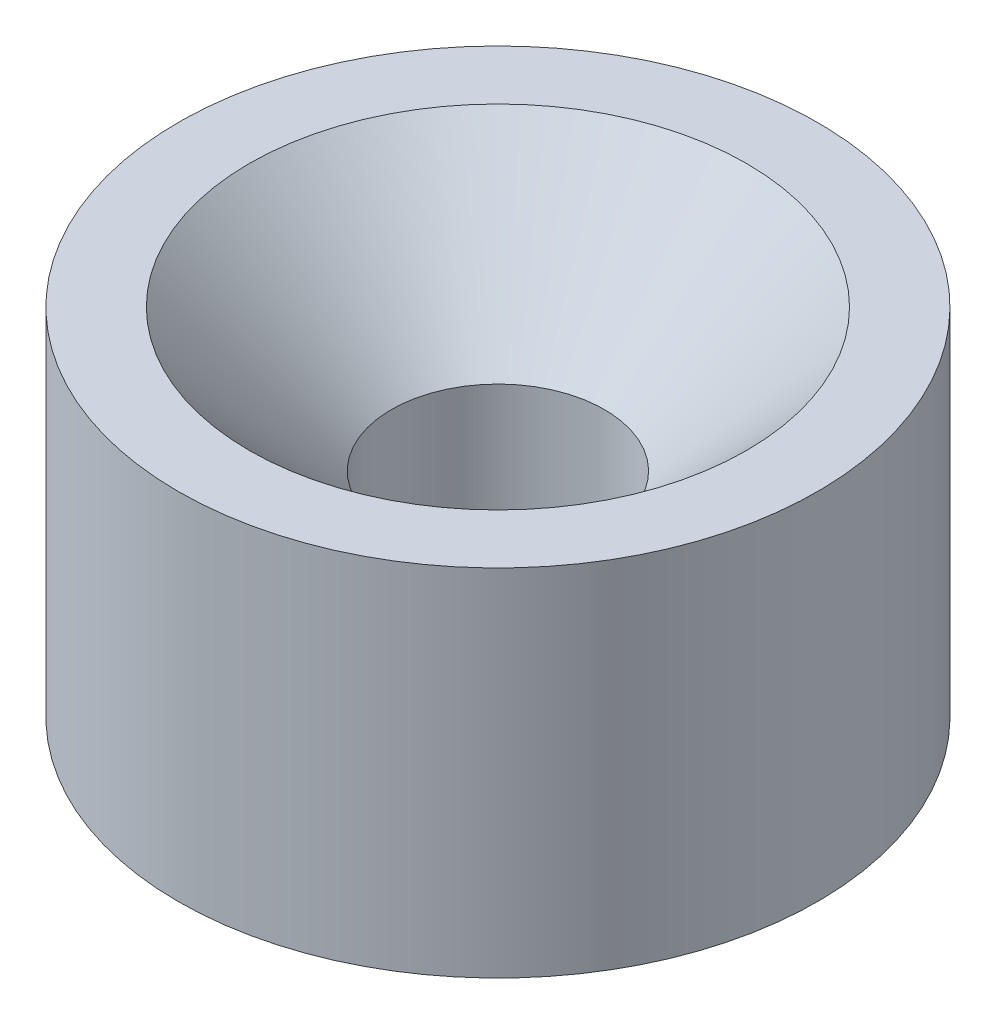
ISO-10303-21;
HEADER;
FILE_DESCRIPTION(('STEP AP214'),'2;1');
FILE_NAME('part.step','',(''),(''),'','','');
FILE_SCHEMA(('AUTOMOTIVE_DESIGN { 1 0 10303 214 1 1 1 1 }'));
ENDSEC;
DATA;
#1=APPLICATION_CONTEXT('core data for automotive mechanical design processes');
#2=APPLICATION_PROTOCOL_DEFINITION('international standard','automotive_design',2000,#1);
#3=PRODUCT_CONTEXT('',#1,'mechanical');
#4=PRODUCT('Part','Part','',(#3));
#5=PRODUCT_RELATED_PRODUCT_CATEGORY('part','',(#4));
#6=PRODUCT_DEFINITION_FORMATION('','',#4);
#7=PRODUCT_DEFINITION_CONTEXT('part definition',#1,'design');
#8=PRODUCT_DEFINITION('design','',#6,#7);
#9=PRODUCT_DEFINITION_SHAPE('','',#8);
#10=(LENGTH_UNIT() NAMED_UNIT(*) SI_UNIT(.MILLI.,.METRE.));
#11=(NAMED_UNIT(*) PLANE_ANGLE_UNIT() SI_UNIT($,.RADIAN.));
#12=(NAMED_UNIT(*) SI_UNIT($,.STERADIAN.) SOLID_ANGLE_UNIT());
#13=UNCERTAINTY_MEASURE_WITH_UNIT(LENGTH_MEASURE(1.E-05),#10,'distance_accuracy_value','');
#14=(GEOMETRIC_REPRESENTATION_CONTEXT(3) GLOBAL_UNCERTAINTY_ASSIGNED_CONTEXT((#13)) GLOBAL_UNIT_ASSIGNED_CONTEXT((#10,
#11,#12)) REPRESENTATION_CONTEXT('',''));
#15=CARTESIAN_POINT('',(0.,0.,0.));
#16=DIRECTION('',(0.,0.,1.));
#17=DIRECTION('',(1.,0.,0.));
#18=AXIS2_PLACEMENT_3D('',#15,#16,#17);
#19=CARTESIAN_POINT('',(0.,5.,0.));
#20=DIRECTION('',(0.,1.,0.));
#21=DIRECTION('',(0.,0.,1.));
#22=AXIS2_PLACEMENT_3D('',#19,#20,#21);
#23=PLANE('',#22);
#24=CARTESIAN_POINT('',(0.,5.,0.));
#25=DIRECTION('',(0.,1.,0.));
#26=DIRECTION('',(0.,0.,1.));
#27=AXIS2_PLACEMENT_3D('',#24,#25,#26);
#28=CIRCLE('',#27,3.50000000000001);
#29=CARTESIAN_POINT('',(0.,5.,3.50000000000001));
#30=VERTEX_POINT('',#29);
#31=EDGE_CURVE('E10',#30,#30,#28,.F.);
#32=ORIENTED_EDGE('',*,*,#31,.T.);
#33=EDGE_LOOP('',(#32));
#34=FACE_BOUND('',#33,.T.);
#35=CARTESIAN_POINT('',(0.,5.,0.));
#36=DIRECTION('',(0.,1.,0.));
#37=DIRECTION('',(0.,0.,1.));
#38=AXIS2_PLACEMENT_3D('',#35,#36,#37);
#39=CIRCLE('',#38,4.5);
#40=CARTESIAN_POINT('',(0.,5.,4.5));
#41=VERTEX_POINT('',#40);
#42=EDGE_CURVE('E51',#41,#41,#39,.T.);
#43=ORIENTED_EDGE('',*,*,#42,.T.);
#44=EDGE_LOOP('',(#43));
#45=FACE_BOUND('',#44,.T.);
#46=ADVANCED_FACE('F39',(#34,#45),#23,.T.);
#47=CARTESIAN_POINT('',(0.,0.,0.));
#48=DIRECTION('',(0.,1.,0.));
#49=DIRECTION('',(0.,0.,1.));
#50=AXIS2_PLACEMENT_3D('',#47,#48,#49);
#51=PLANE('',#50);
#52=CARTESIAN_POINT('',(0.,0.,0.));
#53=DIRECTION('',(0.,1.,0.));
#54=DIRECTION('',(0.,0.,1.));
#55=AXIS2_PLACEMENT_3D('',#52,#53,#54);
#56=CIRCLE('',#55,4.5);
#57=CARTESIAN_POINT('',(0.,0.,4.5));
#58=VERTEX_POINT('',#57);
#59=EDGE_CURVE('E55',#58,#58,#56,.T.);
#60=ORIENTED_EDGE('',*,*,#59,.F.);
#61=EDGE_LOOP('',(#60));
#62=FACE_BOUND('',#61,.T.);
#63=CARTESIAN_POINT('',(0.,0.,0.));
#64=DIRECTION('',(0.,1.,0.));
#65=DIRECTION('',(0.,0.,1.));
#66=AXIS2_PLACEMENT_3D('',#63,#64,#65);
#67=CIRCLE('',#66,1.5);
#68=CARTESIAN_POINT('',(0.,0.,1.5));
#69=VERTEX_POINT('',#68);
#70=EDGE_CURVE('E59',#69,#69,#67,.T.);
#71=ORIENTED_EDGE('',*,*,#70,.T.);
#72=EDGE_LOOP('',(#71));
#73=FACE_BOUND('',#72,.T.);
#74=ADVANCED_FACE('F64',(#62,#73),#51,.F.);
#75=CARTESIAN_POINT('',(0.,5.,0.));
#76=DIRECTION('',(0.,-1.,0.));
#77=DIRECTION('',(0.,0.,-1.));
#78=AXIS2_PLACEMENT_3D('',#75,#76,#77);
#79=CYLINDRICAL_SURFACE('',#78,4.5);
#80=ORIENTED_EDGE('',*,*,#42,.F.);
#81=EDGE_LOOP('',(#80));
#82=FACE_BOUND('',#81,.T.);
#83=ORIENTED_EDGE('',*,*,#59,.T.);
#84=EDGE_LOOP('',(#83));
#85=FACE_BOUND('',#84,.T.);
#86=ADVANCED_FACE('F68',(#82,#85),#79,.T.);
#87=CARTESIAN_POINT('',(0.,5.,0.));
#88=DIRECTION('',(0.,-1.,0.));
#89=DIRECTION('',(0.,0.,-1.));
#90=AXIS2_PLACEMENT_3D('',#87,#88,#89);
#91=CYLINDRICAL_SURFACE('',#90,1.5);
#92=CARTESIAN_POINT('',(0.,3.,0.));
#93=DIRECTION('',(0.,1.,0.));
#94=DIRECTION('',(0.,0.,1.));
#95=AXIS2_PLACEMENT_3D('',#92,#93,#94);
#96=CIRCLE('',#95,1.5);
#97=CARTESIAN_POINT('',(0.,3.,1.5));
#98=VERTEX_POINT('',#97);
#99=EDGE_CURVE('E47',#98,#98,#96,.T.);
#100=ORIENTED_EDGE('',*,*,#99,.T.);
#101=EDGE_LOOP('',(#100));
#102=FACE_BOUND('',#101,.T.);
#103=ORIENTED_EDGE('',*,*,#70,.F.);
#104=EDGE_LOOP('',(#103));
#105=FACE_BOUND('',#104,.T.);
#106=ADVANCED_FACE('F66',(#102,#105),#91,.F.);
#107=CARTESIAN_POINT('',(0.,3.,0.));
#108=DIRECTION('',(0.,1.,0.));
#109=DIRECTION('',(0.,0.,1.));
#110=AXIS2_PLACEMENT_3D('',#107,#108,#109);
#111=CONICAL_SURFACE('',#110,1.5,0.78539816339745);
#112=ORIENTED_EDGE('',*,*,#31,.F.);
#113=EDGE_LOOP('',(#112));
#114=FACE_BOUND('',#113,.T.);
#115=ORIENTED_EDGE('',*,*,#99,.F.);
#116=EDGE_LOOP('',(#115));
#117=FACE_BOUND('',#116,.T.);
#118=ADVANCED_FACE('F42',(#114,#117),#111,.F.);
#119=CLOSED_SHELL('',(#46,#74,#86,#106,#118));
#120=MANIFOLD_SOLID_BREP('B2',#119);
#121=ADVANCED_BREP_SHAPE_REPRESENTATION('',(#18,#120),#14);
#122=SHAPE_DEFINITION_REPRESENTATION(#9,#121);
ENDSEC;
END-ISO-10303-21;
